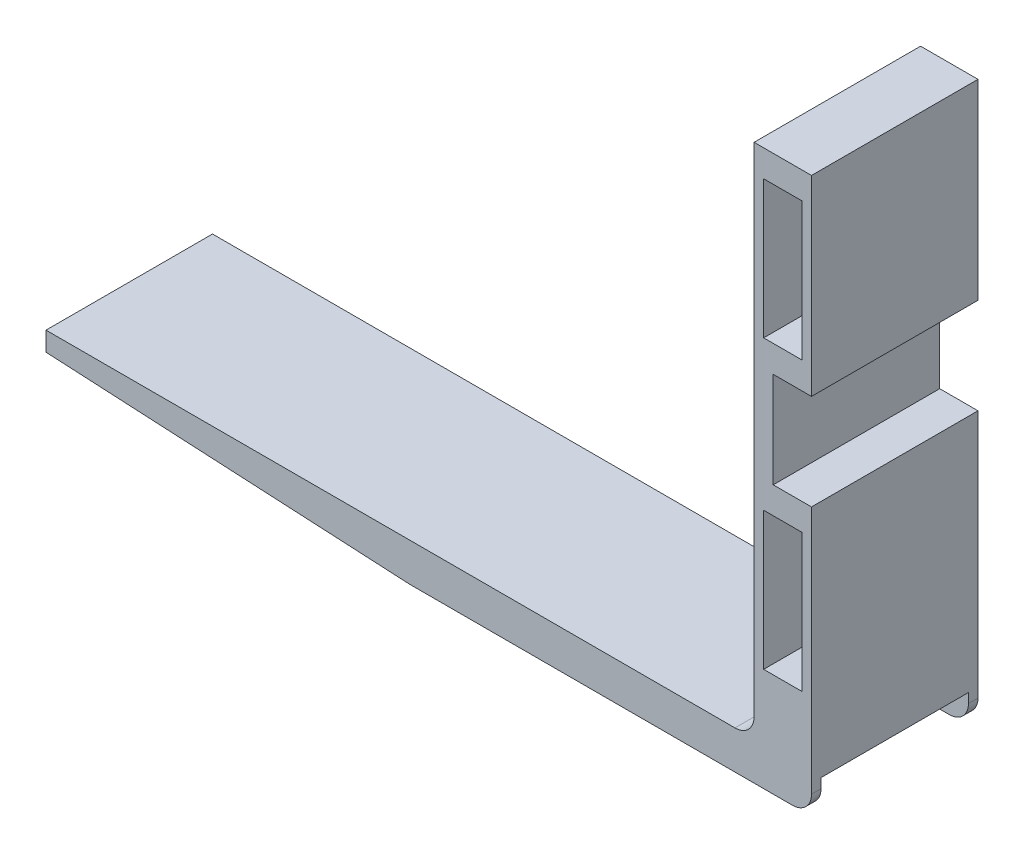
ISO-10303-21;
HEADER;
FILE_DESCRIPTION(('STEP AP214'),'2;1');
FILE_NAME('part.step','',(''),(''),'','','');
FILE_SCHEMA(('AUTOMOTIVE_DESIGN { 1 0 10303 214 1 1 1 1 }'));
ENDSEC;
DATA;
#1=APPLICATION_CONTEXT('core data for automotive mechanical design processes');
#2=APPLICATION_PROTOCOL_DEFINITION('international standard','automotive_design',2000,#1);
#3=PRODUCT_CONTEXT('',#1,'mechanical');
#4=PRODUCT('Part','Part','',(#3));
#5=PRODUCT_RELATED_PRODUCT_CATEGORY('part','',(#4));
#6=PRODUCT_DEFINITION_FORMATION('','',#4);
#7=PRODUCT_DEFINITION_CONTEXT('part definition',#1,'design');
#8=PRODUCT_DEFINITION('design','',#6,#7);
#9=PRODUCT_DEFINITION_SHAPE('','',#8);
#10=(LENGTH_UNIT() NAMED_UNIT(*) SI_UNIT(.MILLI.,.METRE.));
#11=(NAMED_UNIT(*) PLANE_ANGLE_UNIT() SI_UNIT($,.RADIAN.));
#12=(NAMED_UNIT(*) SI_UNIT($,.STERADIAN.) SOLID_ANGLE_UNIT());
#13=UNCERTAINTY_MEASURE_WITH_UNIT(LENGTH_MEASURE(1.E-05),#10,'distance_accuracy_value','');
#14=(GEOMETRIC_REPRESENTATION_CONTEXT(3) GLOBAL_UNCERTAINTY_ASSIGNED_CONTEXT((#13)) GLOBAL_UNIT_ASSIGNED_CONTEXT((#10,
#11,#12)) REPRESENTATION_CONTEXT('',''));
#15=CARTESIAN_POINT('',(0.,0.,0.));
#16=DIRECTION('',(0.,0.,1.));
#17=DIRECTION('',(1.,0.,0.));
#18=AXIS2_PLACEMENT_3D('',#15,#16,#17);
#19=CARTESIAN_POINT('',(-11.9999999999998,-160.294090378542,87.));
#20=DIRECTION('',(0.0525588331227632,0.99861782933251,0.));
#21=DIRECTION('',(-0.99861782933251,0.0525588331227632,0.));
#22=AXIS2_PLACEMENT_3D('',#19,#20,#21);
#23=PLANE('',#22);
#24=DIRECTION('',(0.,0.,-1.));
#25=VECTOR('',#24,1.);
#26=CARTESIAN_POINT('',(-202.,-150.294090378542,87.));
#27=LINE('',#26,#25);
#28=CARTESIAN_POINT('',(-202.,-150.294090378542,87.));
#29=VERTEX_POINT('',#28);
#30=CARTESIAN_POINT('',(-202.,-150.294090378542,82.0379413430987));
#31=VERTEX_POINT('',#30);
#32=EDGE_CURVE('E407',#29,#31,#27,.T.);
#33=ORIENTED_EDGE('',*,*,#32,.T.);
#34=DIRECTION('',(0.99861782933251,-0.0525588331227632,0.));
#35=VECTOR('',#34,1.);
#36=CARTESIAN_POINT('',(-11.9999999999998,-160.294090378542,82.0379413430987));
#37=LINE('',#36,#35);
#38=CARTESIAN_POINT('',(-11.9999999999998,-160.294090378542,82.0379413430987));
#39=VERTEX_POINT('',#38);
#40=EDGE_CURVE('E256',#31,#39,#37,.T.);
#41=ORIENTED_EDGE('',*,*,#40,.T.);
#42=DIRECTION('',(0.,0.,-1.));
#43=VECTOR('',#42,1.);
#44=CARTESIAN_POINT('',(-11.9999999999998,-160.294090378542,87.));
#45=LINE('',#44,#43);
#46=CARTESIAN_POINT('',(-11.9999999999998,-160.294090378542,87.));
#47=VERTEX_POINT('',#46);
#48=EDGE_CURVE('E404',#47,#39,#45,.T.);
#49=ORIENTED_EDGE('',*,*,#48,.F.);
#50=DIRECTION('',(0.99861782933251,-0.0525588331227632,0.));
#51=VECTOR('',#50,1.);
#52=CARTESIAN_POINT('',(-11.9999999999998,-160.294090378542,87.));
#53=LINE('',#52,#51);
#54=EDGE_CURVE('E330',#29,#47,#53,.T.);
#55=ORIENTED_EDGE('',*,*,#54,.F.);
#56=EDGE_LOOP('',(#33,#41,#49,#55));
#57=FACE_BOUND('',#56,.T.);
#58=ADVANCED_FACE('F39',(#57),#23,.F.);
#59=CARTESIAN_POINT('',(188.,-160.294090378542,87.));
#60=DIRECTION('',(0.,1.,0.));
#61=DIRECTION('',(-1.,0.,0.));
#62=AXIS2_PLACEMENT_3D('',#59,#60,#61);
#63=PLANE('',#62);
#64=ORIENTED_EDGE('',*,*,#48,.T.);
#65=DIRECTION('',(1.,0.,0.));
#66=VECTOR('',#65,1.);
#67=CARTESIAN_POINT('',(188.,-160.294090378542,82.0379413430987));
#68=LINE('',#67,#66);
#69=CARTESIAN_POINT('',(188.,-160.294090378542,82.0379413430987));
#70=VERTEX_POINT('',#69);
#71=EDGE_CURVE('E253',#39,#70,#68,.T.);
#72=ORIENTED_EDGE('',*,*,#71,.T.);
#73=DIRECTION('',(0.,0.,-1.));
#74=VECTOR('',#73,1.);
#75=CARTESIAN_POINT('',(188.,-160.294090378542,87.));
#76=LINE('',#75,#74);
#77=CARTESIAN_POINT('',(188.,-160.294090378542,87.));
#78=VERTEX_POINT('',#77);
#79=EDGE_CURVE('E400',#78,#70,#76,.T.);
#80=ORIENTED_EDGE('',*,*,#79,.F.);
#81=DIRECTION('',(1.,0.,0.));
#82=VECTOR('',#81,1.);
#83=CARTESIAN_POINT('',(188.,-160.294090378542,87.));
#84=LINE('',#83,#82);
#85=EDGE_CURVE('E332',#47,#78,#84,.T.);
#86=ORIENTED_EDGE('',*,*,#85,.F.);
#87=EDGE_LOOP('',(#64,#72,#80,#86));
#88=FACE_BOUND('',#87,.T.);
#89=ADVANCED_FACE('F479',(#88),#63,.F.);
#90=CARTESIAN_POINT('',(188.,-150.294090378542,87.));
#91=DIRECTION('',(0.,0.,-1.));
#92=DIRECTION('',(-1.,0.,0.));
#93=AXIS2_PLACEMENT_3D('',#90,#91,#92);
#94=CYLINDRICAL_SURFACE('',#93,9.99999999999998);
#95=ORIENTED_EDGE('',*,*,#79,.T.);
#96=CARTESIAN_POINT('',(188.,-150.294090378542,82.0379413430987));
#97=DIRECTION('',(0.,0.,1.));
#98=DIRECTION('',(1.,0.,0.));
#99=AXIS2_PLACEMENT_3D('',#96,#97,#98);
#100=CIRCLE('',#99,9.99999999999998);
#101=CARTESIAN_POINT('',(198.,-150.294090378542,82.0379413430987));
#102=VERTEX_POINT('',#101);
#103=EDGE_CURVE('E250',#70,#102,#100,.T.);
#104=ORIENTED_EDGE('',*,*,#103,.T.);
#105=DIRECTION('',(0.,0.,-1.));
#106=VECTOR('',#105,1.);
#107=CARTESIAN_POINT('',(198.,-150.294090378542,87.));
#108=LINE('',#107,#106);
#109=CARTESIAN_POINT('',(198.,-150.294090378542,87.));
#110=VERTEX_POINT('',#109);
#111=EDGE_CURVE('E396',#110,#102,#108,.T.);
#112=ORIENTED_EDGE('',*,*,#111,.F.);
#113=CARTESIAN_POINT('',(188.,-150.294090378542,87.));
#114=DIRECTION('',(0.,0.,1.));
#115=DIRECTION('',(1.,0.,0.));
#116=AXIS2_PLACEMENT_3D('',#113,#114,#115);
#117=CIRCLE('',#116,9.99999999999998);
#118=EDGE_CURVE('E334',#78,#110,#117,.T.);
#119=ORIENTED_EDGE('',*,*,#118,.F.);
#120=EDGE_LOOP('',(#95,#104,#112,#119));
#121=FACE_BOUND('',#120,.T.);
#122=ADVANCED_FACE('F477',(#121),#94,.T.);
#123=CARTESIAN_POINT('',(158.,-130.294090378542,87.));
#124=DIRECTION('',(0.,0.,-1.));
#125=DIRECTION('',(-1.,0.,0.));
#126=AXIS2_PLACEMENT_3D('',#123,#124,#125);
#127=PLANE('',#126);
#128=DIRECTION('',(0.,1.,0.));
#129=VECTOR('',#128,1.);
#130=CARTESIAN_POINT('',(193.,-34.2940903785418,87.));
#131=LINE('',#130,#129);
#132=CARTESIAN_POINT('',(193.,-106.294090378542,87.));
#133=VERTEX_POINT('',#132);
#134=CARTESIAN_POINT('',(193.,-34.2940903785418,87.));
#135=VERTEX_POINT('',#134);
#136=EDGE_CURVE('E289',#133,#135,#131,.T.);
#137=ORIENTED_EDGE('',*,*,#136,.F.);
#138=DIRECTION('',(1.,0.,0.));
#139=VECTOR('',#138,1.);
#140=CARTESIAN_POINT('',(173.,-106.294090378542,87.));
#141=LINE('',#140,#139);
#142=CARTESIAN_POINT('',(173.,-106.294090378542,87.));
#143=VERTEX_POINT('',#142);
#144=EDGE_CURVE('E297',#143,#133,#141,.T.);
#145=ORIENTED_EDGE('',*,*,#144,.F.);
#146=DIRECTION('',(0.,-1.,0.));
#147=VECTOR('',#146,1.);
#148=CARTESIAN_POINT('',(173.,-34.2940903785418,87.));
#149=LINE('',#148,#147);
#150=CARTESIAN_POINT('',(173.,-34.2940903785418,87.));
#151=VERTEX_POINT('',#150);
#152=EDGE_CURVE('E294',#151,#143,#149,.T.);
#153=ORIENTED_EDGE('',*,*,#152,.F.);
#154=DIRECTION('',(-1.,0.,0.));
#155=VECTOR('',#154,1.);
#156=CARTESIAN_POINT('',(173.,-34.2940903785418,87.));
#157=LINE('',#156,#155);
#158=EDGE_CURVE('E291',#135,#151,#157,.T.);
#159=ORIENTED_EDGE('',*,*,#158,.F.);
#160=EDGE_LOOP('',(#137,#145,#153,#159));
#161=FACE_BOUND('',#160,.T.);
#162=DIRECTION('',(0.,-1.,0.));
#163=VECTOR('',#162,1.);
#164=CARTESIAN_POINT('',(168.,129.705909621458,87.));
#165=LINE('',#164,#163);
#166=CARTESIAN_POINT('',(168.,129.705909621458,87.));
#167=VERTEX_POINT('',#166);
#168=CARTESIAN_POINT('',(168.,-130.294090378542,87.));
#169=VERTEX_POINT('',#168);
#170=EDGE_CURVE('E320',#167,#169,#165,.T.);
#171=ORIENTED_EDGE('',*,*,#170,.T.);
#172=CARTESIAN_POINT('',(158.,-130.294090378542,87.));
#173=DIRECTION('',(0.,0.,-1.));
#174=DIRECTION('',(-1.,0.,0.));
#175=AXIS2_PLACEMENT_3D('',#172,#173,#174);
#176=CIRCLE('',#175,10.);
#177=CARTESIAN_POINT('',(158.,-140.294090378542,87.));
#178=VERTEX_POINT('',#177);
#179=EDGE_CURVE('E323',#169,#178,#176,.T.);
#180=ORIENTED_EDGE('',*,*,#179,.T.);
#181=DIRECTION('',(-1.,0.,0.));
#182=VECTOR('',#181,1.);
#183=CARTESIAN_POINT('',(158.,-140.294090378542,87.));
#184=LINE('',#183,#182);
#185=CARTESIAN_POINT('',(-202.,-140.294090378542,87.));
#186=VERTEX_POINT('',#185);
#187=EDGE_CURVE('E326',#178,#186,#184,.T.);
#188=ORIENTED_EDGE('',*,*,#187,.T.);
#189=DIRECTION('',(0.,-1.,0.));
#190=VECTOR('',#189,1.);
#191=CARTESIAN_POINT('',(-202.,-150.294090378542,87.));
#192=LINE('',#191,#190);
#193=EDGE_CURVE('E328',#186,#29,#192,.T.);
#194=ORIENTED_EDGE('',*,*,#193,.T.);
#195=ORIENTED_EDGE('',*,*,#54,.T.);
#196=ORIENTED_EDGE('',*,*,#85,.T.);
#197=ORIENTED_EDGE('',*,*,#118,.T.);
#198=DIRECTION('',(0.,1.,0.));
#199=VECTOR('',#198,1.);
#200=CARTESIAN_POINT('',(198.,-150.294090378542,87.));
#201=LINE('',#200,#199);
#202=CARTESIAN_POINT('',(198.,-20.2940903785418,87.));
#203=VERTEX_POINT('',#202);
#204=EDGE_CURVE('E336',#110,#203,#201,.T.);
#205=ORIENTED_EDGE('',*,*,#204,.T.);
#206=DIRECTION('',(-1.,0.,0.));
#207=VECTOR('',#206,1.);
#208=CARTESIAN_POINT('',(178.,-20.2940903785418,87.));
#209=LINE('',#208,#207);
#210=CARTESIAN_POINT('',(178.,-20.2940903785418,87.));
#211=VERTEX_POINT('',#210);
#212=EDGE_CURVE('E338',#203,#211,#209,.T.);
#213=ORIENTED_EDGE('',*,*,#212,.T.);
#214=DIRECTION('',(0.,1.,0.));
#215=VECTOR('',#214,1.);
#216=CARTESIAN_POINT('',(178.,29.7059096214582,87.));
#217=LINE('',#216,#215);
#218=CARTESIAN_POINT('',(178.,29.7059096214582,87.));
#219=VERTEX_POINT('',#218);
#220=EDGE_CURVE('E340',#211,#219,#217,.T.);
#221=ORIENTED_EDGE('',*,*,#220,.T.);
#222=DIRECTION('',(1.,0.,0.));
#223=VECTOR('',#222,1.);
#224=CARTESIAN_POINT('',(198.,29.7059096214582,87.));
#225=LINE('',#224,#223);
#226=CARTESIAN_POINT('',(198.,29.7059096214582,87.));
#227=VERTEX_POINT('',#226);
#228=EDGE_CURVE('E342',#219,#227,#225,.T.);
#229=ORIENTED_EDGE('',*,*,#228,.T.);
#230=DIRECTION('',(0.,1.,0.));
#231=VECTOR('',#230,1.);
#232=CARTESIAN_POINT('',(198.,29.7059096214582,87.));
#233=LINE('',#232,#231);
#234=CARTESIAN_POINT('',(198.,129.705909621458,87.));
#235=VERTEX_POINT('',#234);
#236=EDGE_CURVE('E344',#227,#235,#233,.T.);
#237=ORIENTED_EDGE('',*,*,#236,.T.);
#238=DIRECTION('',(-1.,0.,0.));
#239=VECTOR('',#238,1.);
#240=CARTESIAN_POINT('',(198.,129.705909621458,87.));
#241=LINE('',#240,#239);
#242=EDGE_CURVE('E346',#235,#167,#241,.T.);
#243=ORIENTED_EDGE('',*,*,#242,.T.);
#244=EDGE_LOOP('',(#171,#180,#188,#194,#195,#196,#197,#205,#213,#221,#229,#237,#243));
#245=FACE_BOUND('',#244,.T.);
#246=DIRECTION('',(1.,0.,0.));
#247=VECTOR('',#246,1.);
#248=CARTESIAN_POINT('',(173.,43.7059096214582,87.));
#249=LINE('',#248,#247);
#250=CARTESIAN_POINT('',(173.,43.7059096214582,87.));
#251=VERTEX_POINT('',#250);
#252=CARTESIAN_POINT('',(193.,43.7059096214582,87.));
#253=VERTEX_POINT('',#252);
#254=EDGE_CURVE('E260',#251,#253,#249,.T.);
#255=ORIENTED_EDGE('',*,*,#254,.F.);
#256=DIRECTION('',(0.,-1.,0.));
#257=VECTOR('',#256,1.);
#258=CARTESIAN_POINT('',(173.,115.705909621458,87.));
#259=LINE('',#258,#257);
#260=CARTESIAN_POINT('',(173.,115.705909621458,87.));
#261=VERTEX_POINT('',#260);
#262=EDGE_CURVE('E267',#261,#251,#259,.T.);
#263=ORIENTED_EDGE('',*,*,#262,.F.);
#264=DIRECTION('',(-1.,0.,0.));
#265=VECTOR('',#264,1.);
#266=CARTESIAN_POINT('',(173.,115.705909621458,87.));
#267=LINE('',#266,#265);
#268=CARTESIAN_POINT('',(193.,115.705909621458,87.));
#269=VERTEX_POINT('',#268);
#270=EDGE_CURVE('E265',#269,#261,#267,.T.);
#271=ORIENTED_EDGE('',*,*,#270,.F.);
#272=DIRECTION('',(0.,1.,0.));
#273=VECTOR('',#272,1.);
#274=CARTESIAN_POINT('',(193.,115.705909621458,87.));
#275=LINE('',#274,#273);
#276=EDGE_CURVE('E262',#253,#269,#275,.T.);
#277=ORIENTED_EDGE('',*,*,#276,.F.);
#278=EDGE_LOOP('',(#255,#263,#271,#277));
#279=FACE_BOUND('',#278,.T.);
#280=ADVANCED_FACE('F431',(#161,#245,#279),#127,.F.);
#281=CARTESIAN_POINT('',(158.,-130.294090378542,0.));
#282=DIRECTION('',(0.,0.,-1.));
#283=DIRECTION('',(-1.,0.,0.));
#284=AXIS2_PLACEMENT_3D('',#281,#282,#283);
#285=PLANE('',#284);
#286=DIRECTION('',(0.,-1.,0.));
#287=VECTOR('',#286,1.);
#288=CARTESIAN_POINT('',(168.,129.705909621458,0.));
#289=LINE('',#288,#287);
#290=CARTESIAN_POINT('',(168.,129.705909621458,0.));
#291=VERTEX_POINT('',#290);
#292=CARTESIAN_POINT('',(168.,-130.294090378542,0.));
#293=VERTEX_POINT('',#292);
#294=EDGE_CURVE('E319',#291,#293,#289,.T.);
#295=ORIENTED_EDGE('',*,*,#294,.F.);
#296=DIRECTION('',(-1.,0.,0.));
#297=VECTOR('',#296,1.);
#298=CARTESIAN_POINT('',(198.,129.705909621458,0.));
#299=LINE('',#298,#297);
#300=CARTESIAN_POINT('',(198.,129.705909621458,0.));
#301=VERTEX_POINT('',#300);
#302=EDGE_CURVE('E324',#301,#291,#299,.T.);
#303=ORIENTED_EDGE('',*,*,#302,.F.);
#304=DIRECTION('',(0.,1.,0.));
#305=VECTOR('',#304,1.);
#306=CARTESIAN_POINT('',(198.,29.7059096214582,0.));
#307=LINE('',#306,#305);
#308=CARTESIAN_POINT('',(198.,29.7059096214582,0.));
#309=VERTEX_POINT('',#308);
#310=EDGE_CURVE('E375',#309,#301,#307,.T.);
#311=ORIENTED_EDGE('',*,*,#310,.F.);
#312=DIRECTION('',(1.,0.,0.));
#313=VECTOR('',#312,1.);
#314=CARTESIAN_POINT('',(198.,29.7059096214582,0.));
#315=LINE('',#314,#313);
#316=CARTESIAN_POINT('',(178.,29.7059096214582,0.));
#317=VERTEX_POINT('',#316);
#318=EDGE_CURVE('E373',#317,#309,#315,.T.);
#319=ORIENTED_EDGE('',*,*,#318,.F.);
#320=DIRECTION('',(0.,1.,0.));
#321=VECTOR('',#320,1.);
#322=CARTESIAN_POINT('',(178.,29.7059096214582,0.));
#323=LINE('',#322,#321);
#324=CARTESIAN_POINT('',(178.,-20.2940903785418,0.));
#325=VERTEX_POINT('',#324);
#326=EDGE_CURVE('E371',#325,#317,#323,.T.);
#327=ORIENTED_EDGE('',*,*,#326,.F.);
#328=DIRECTION('',(-1.,0.,0.));
#329=VECTOR('',#328,1.);
#330=CARTESIAN_POINT('',(178.,-20.2940903785418,0.));
#331=LINE('',#330,#329);
#332=CARTESIAN_POINT('',(198.,-20.2940903785418,0.));
#333=VERTEX_POINT('',#332);
#334=EDGE_CURVE('E369',#333,#325,#331,.T.);
#335=ORIENTED_EDGE('',*,*,#334,.F.);
#336=DIRECTION('',(0.,1.,0.));
#337=VECTOR('',#336,1.);
#338=CARTESIAN_POINT('',(198.,-150.294090378542,0.));
#339=LINE('',#338,#337);
#340=CARTESIAN_POINT('',(198.,-150.294090378542,0.));
#341=VERTEX_POINT('',#340);
#342=EDGE_CURVE('E367',#341,#333,#339,.T.);
#343=ORIENTED_EDGE('',*,*,#342,.F.);
#344=CARTESIAN_POINT('',(188.,-150.294090378542,0.));
#345=DIRECTION('',(0.,0.,1.));
#346=DIRECTION('',(1.,0.,0.));
#347=AXIS2_PLACEMENT_3D('',#344,#345,#346);
#348=CIRCLE('',#347,9.99999999999998);
#349=CARTESIAN_POINT('',(188.,-160.294090378542,0.));
#350=VERTEX_POINT('',#349);
#351=EDGE_CURVE('E364',#350,#341,#348,.T.);
#352=ORIENTED_EDGE('',*,*,#351,.F.);
#353=DIRECTION('',(1.,0.,0.));
#354=VECTOR('',#353,1.);
#355=CARTESIAN_POINT('',(188.,-160.294090378542,0.));
#356=LINE('',#355,#354);
#357=CARTESIAN_POINT('',(-11.9999999999998,-160.294090378542,0.));
#358=VERTEX_POINT('',#357);
#359=EDGE_CURVE('E361',#358,#350,#356,.T.);
#360=ORIENTED_EDGE('',*,*,#359,.F.);
#361=DIRECTION('',(0.99861782933251,-0.0525588331227632,0.));
#362=VECTOR('',#361,1.);
#363=CARTESIAN_POINT('',(-11.9999999999998,-160.294090378542,0.));
#364=LINE('',#363,#362);
#365=CARTESIAN_POINT('',(-202.,-150.294090378542,0.));
#366=VERTEX_POINT('',#365);
#367=EDGE_CURVE('E358',#366,#358,#364,.T.);
#368=ORIENTED_EDGE('',*,*,#367,.F.);
#369=DIRECTION('',(0.,-1.,0.));
#370=VECTOR('',#369,1.);
#371=CARTESIAN_POINT('',(-202.,-150.294090378542,0.));
#372=LINE('',#371,#370);
#373=CARTESIAN_POINT('',(-202.,-140.294090378542,0.));
#374=VERTEX_POINT('',#373);
#375=EDGE_CURVE('E356',#374,#366,#372,.T.);
#376=ORIENTED_EDGE('',*,*,#375,.F.);
#377=DIRECTION('',(-1.,0.,0.));
#378=VECTOR('',#377,1.);
#379=CARTESIAN_POINT('',(148.,-140.294090378542,0.));
#380=LINE('',#379,#378);
#381=CARTESIAN_POINT('',(158.,-140.294090378542,0.));
#382=VERTEX_POINT('',#381);
#383=EDGE_CURVE('E354',#382,#374,#380,.T.);
#384=ORIENTED_EDGE('',*,*,#383,.F.);
#385=CARTESIAN_POINT('',(158.,-130.294090378542,0.));
#386=DIRECTION('',(0.,0.,-1.));
#387=DIRECTION('',(-1.,0.,0.));
#388=AXIS2_PLACEMENT_3D('',#385,#386,#387);
#389=CIRCLE('',#388,10.);
#390=EDGE_CURVE('E351',#293,#382,#389,.T.);
#391=ORIENTED_EDGE('',*,*,#390,.F.);
#392=EDGE_LOOP('',(#295,#303,#311,#319,#327,#335,#343,#352,#360,#368,#376,#384,#391));
#393=FACE_BOUND('',#392,.T.);
#394=DIRECTION('',(1.,0.,0.));
#395=VECTOR('',#394,1.);
#396=CARTESIAN_POINT('',(173.,-106.294090378542,0.));
#397=LINE('',#396,#395);
#398=CARTESIAN_POINT('',(173.,-106.294090378542,0.));
#399=VERTEX_POINT('',#398);
#400=CARTESIAN_POINT('',(193.,-106.294090378542,0.));
#401=VERTEX_POINT('',#400);
#402=EDGE_CURVE('E292',#399,#401,#397,.T.);
#403=ORIENTED_EDGE('',*,*,#402,.T.);
#404=DIRECTION('',(0.,1.,0.));
#405=VECTOR('',#404,1.);
#406=CARTESIAN_POINT('',(193.,-34.2940903785418,0.));
#407=LINE('',#406,#405);
#408=CARTESIAN_POINT('',(193.,-34.2940903785418,0.));
#409=VERTEX_POINT('',#408);
#410=EDGE_CURVE('E288',#401,#409,#407,.T.);
#411=ORIENTED_EDGE('',*,*,#410,.T.);
#412=DIRECTION('',(-1.,0.,0.));
#413=VECTOR('',#412,1.);
#414=CARTESIAN_POINT('',(173.,-34.2940903785418,0.));
#415=LINE('',#414,#413);
#416=CARTESIAN_POINT('',(173.,-34.2940903785418,0.));
#417=VERTEX_POINT('',#416);
#418=EDGE_CURVE('E302',#409,#417,#415,.T.);
#419=ORIENTED_EDGE('',*,*,#418,.T.);
#420=DIRECTION('',(0.,-1.,0.));
#421=VECTOR('',#420,1.);
#422=CARTESIAN_POINT('',(173.,-34.2940903785418,0.));
#423=LINE('',#422,#421);
#424=EDGE_CURVE('E305',#417,#399,#423,.T.);
#425=ORIENTED_EDGE('',*,*,#424,.T.);
#426=EDGE_LOOP('',(#403,#411,#419,#425));
#427=FACE_BOUND('',#426,.T.);
#428=DIRECTION('',(0.,-1.,0.));
#429=VECTOR('',#428,1.);
#430=CARTESIAN_POINT('',(173.,115.705909621458,0.));
#431=LINE('',#430,#429);
#432=CARTESIAN_POINT('',(173.,115.705909621458,0.));
#433=VERTEX_POINT('',#432);
#434=CARTESIAN_POINT('',(173.,43.7059096214582,0.));
#435=VERTEX_POINT('',#434);
#436=EDGE_CURVE('E263',#433,#435,#431,.T.);
#437=ORIENTED_EDGE('',*,*,#436,.T.);
#438=DIRECTION('',(1.,0.,0.));
#439=VECTOR('',#438,1.);
#440=CARTESIAN_POINT('',(173.,43.7059096214582,0.));
#441=LINE('',#440,#439);
#442=CARTESIAN_POINT('',(193.,43.7059096214582,0.));
#443=VERTEX_POINT('',#442);
#444=EDGE_CURVE('E259',#435,#443,#441,.T.);
#445=ORIENTED_EDGE('',*,*,#444,.T.);
#446=DIRECTION('',(0.,1.,0.));
#447=VECTOR('',#446,1.);
#448=CARTESIAN_POINT('',(193.,115.705909621458,0.));
#449=LINE('',#448,#447);
#450=CARTESIAN_POINT('',(193.,115.705909621458,0.));
#451=VERTEX_POINT('',#450);
#452=EDGE_CURVE('E272',#443,#451,#449,.T.);
#453=ORIENTED_EDGE('',*,*,#452,.T.);
#454=DIRECTION('',(-1.,0.,0.));
#455=VECTOR('',#454,1.);
#456=CARTESIAN_POINT('',(173.,115.705909621458,0.));
#457=LINE('',#456,#455);
#458=EDGE_CURVE('E275',#451,#433,#457,.T.);
#459=ORIENTED_EDGE('',*,*,#458,.T.);
#460=EDGE_LOOP('',(#437,#445,#453,#459));
#461=FACE_BOUND('',#460,.T.);
#462=ADVANCED_FACE('F441',(#393,#427,#461),#285,.T.);
#463=CARTESIAN_POINT('',(168.,129.705909621458,87.));
#464=DIRECTION('',(1.,0.,0.));
#465=DIRECTION('',(0.,0.,-1.));
#466=AXIS2_PLACEMENT_3D('',#463,#464,#465);
#467=PLANE('',#466);
#468=ORIENTED_EDGE('',*,*,#294,.T.);
#469=DIRECTION('',(0.,0.,-1.));
#470=VECTOR('',#469,1.);
#471=CARTESIAN_POINT('',(168.,-130.294090378542,87.));
#472=LINE('',#471,#470);
#473=EDGE_CURVE('E416',#169,#293,#472,.T.);
#474=ORIENTED_EDGE('',*,*,#473,.F.);
#475=ORIENTED_EDGE('',*,*,#170,.F.);
#476=DIRECTION('',(0.,0.,-1.));
#477=VECTOR('',#476,1.);
#478=CARTESIAN_POINT('',(168.,129.705909621458,87.));
#479=LINE('',#478,#477);
#480=EDGE_CURVE('E348',#167,#291,#479,.T.);
#481=ORIENTED_EDGE('',*,*,#480,.T.);
#482=EDGE_LOOP('',(#468,#474,#475,#481));
#483=FACE_BOUND('',#482,.T.);
#484=ADVANCED_FACE('F41',(#483),#467,.F.);
#485=CARTESIAN_POINT('',(158.,-130.294090378542,87.));
#486=DIRECTION('',(0.,0.,-1.));
#487=DIRECTION('',(-1.,0.,0.));
#488=AXIS2_PLACEMENT_3D('',#485,#486,#487);
#489=CYLINDRICAL_SURFACE('',#488,10.);
#490=ORIENTED_EDGE('',*,*,#390,.T.);
#491=DIRECTION('',(0.,0.,-1.));
#492=VECTOR('',#491,1.);
#493=CARTESIAN_POINT('',(158.,-140.294090378542,87.));
#494=LINE('',#493,#492);
#495=EDGE_CURVE('E413',#178,#382,#494,.T.);
#496=ORIENTED_EDGE('',*,*,#495,.F.);
#497=ORIENTED_EDGE('',*,*,#179,.F.);
#498=ORIENTED_EDGE('',*,*,#473,.T.);
#499=EDGE_LOOP('',(#490,#496,#497,#498));
#500=FACE_BOUND('',#499,.T.);
#501=ADVANCED_FACE('F500',(#500),#489,.F.);
#502=CARTESIAN_POINT('',(148.,-140.294090378542,87.));
#503=DIRECTION('',(0.,-1.,0.));
#504=DIRECTION('',(1.,0.,0.));
#505=AXIS2_PLACEMENT_3D('',#502,#503,#504);
#506=PLANE('',#505);
#507=ORIENTED_EDGE('',*,*,#383,.T.);
#508=DIRECTION('',(0.,0.,-1.));
#509=VECTOR('',#508,1.);
#510=CARTESIAN_POINT('',(-202.,-140.294090378542,87.));
#511=LINE('',#510,#509);
#512=EDGE_CURVE('E410',#186,#374,#511,.T.);
#513=ORIENTED_EDGE('',*,*,#512,.F.);
#514=ORIENTED_EDGE('',*,*,#187,.F.);
#515=ORIENTED_EDGE('',*,*,#495,.T.);
#516=EDGE_LOOP('',(#507,#513,#514,#515));
#517=FACE_BOUND('',#516,.T.);
#518=ADVANCED_FACE('F496',(#517),#506,.F.);
#519=CARTESIAN_POINT('',(-202.,-150.294090378542,87.));
#520=DIRECTION('',(1.,0.,0.));
#521=DIRECTION('',(0.,0.,-1.));
#522=AXIS2_PLACEMENT_3D('',#519,#520,#521);
#523=PLANE('',#522);
#524=DIRECTION('',(0.,0.,-1.));
#525=VECTOR('',#524,1.);
#526=CARTESIAN_POINT('',(-202.,-145.294090378542,5.));
#527=LINE('',#526,#525);
#528=CARTESIAN_POINT('',(-202.,-145.294090378542,82.0379413430987));
#529=VERTEX_POINT('',#528);
#530=CARTESIAN_POINT('',(-202.,-145.294090378542,5.));
#531=VERTEX_POINT('',#530);
#532=EDGE_CURVE('E229',#529,#531,#527,.T.);
#533=ORIENTED_EDGE('',*,*,#532,.F.);
#534=DIRECTION('',(0.,1.,0.));
#535=VECTOR('',#534,1.);
#536=CARTESIAN_POINT('',(-202.,-145.294090378542,82.0379413430987));
#537=LINE('',#536,#535);
#538=EDGE_CURVE('E226',#31,#529,#537,.T.);
#539=ORIENTED_EDGE('',*,*,#538,.F.);
#540=ORIENTED_EDGE('',*,*,#32,.F.);
#541=ORIENTED_EDGE('',*,*,#193,.F.);
#542=ORIENTED_EDGE('',*,*,#512,.T.);
#543=ORIENTED_EDGE('',*,*,#375,.T.);
#544=CARTESIAN_POINT('',(-202.,-150.294090378542,5.));
#545=VERTEX_POINT('',#544);
#546=EDGE_CURVE('E239',#545,#366,#27,.T.);
#547=ORIENTED_EDGE('',*,*,#546,.F.);
#548=DIRECTION('',(0.,-1.,0.));
#549=VECTOR('',#548,1.);
#550=CARTESIAN_POINT('',(-202.,-145.294090378542,5.));
#551=LINE('',#550,#549);
#552=EDGE_CURVE('E220',#531,#545,#551,.T.);
#553=ORIENTED_EDGE('',*,*,#552,.F.);
#554=EDGE_LOOP('',(#533,#539,#540,#541,#542,#543,#547,#553));
#555=FACE_BOUND('',#554,.T.);
#556=ADVANCED_FACE('F237',(#555),#523,.F.);
#557=CARTESIAN_POINT('',(-11.9999999999998,-160.294090378542,5.));
#558=VERTEX_POINT('',#557);
#559=EDGE_CURVE('E403',#558,#358,#45,.T.);
#560=ORIENTED_EDGE('',*,*,#559,.F.);
#561=DIRECTION('',(-0.99861782933251,0.0525588331227632,0.));
#562=VECTOR('',#561,1.);
#563=CARTESIAN_POINT('',(-11.9999999999998,-160.294090378542,5.));
#564=LINE('',#563,#562);
#565=EDGE_CURVE('E248',#558,#545,#564,.T.);
#566=ORIENTED_EDGE('',*,*,#565,.T.);
#567=ORIENTED_EDGE('',*,*,#546,.T.);
#568=ORIENTED_EDGE('',*,*,#367,.T.);
#569=EDGE_LOOP('',(#560,#566,#567,#568));
#570=FACE_BOUND('',#569,.T.);
#571=ADVANCED_FACE('F447',(#570),#23,.F.);
#572=CARTESIAN_POINT('',(188.,-160.294090378542,5.));
#573=VERTEX_POINT('',#572);
#574=EDGE_CURVE('E399',#573,#350,#76,.T.);
#575=ORIENTED_EDGE('',*,*,#574,.F.);
#576=DIRECTION('',(-1.,0.,0.));
#577=VECTOR('',#576,1.);
#578=CARTESIAN_POINT('',(188.,-160.294090378542,5.));
#579=LINE('',#578,#577);
#580=EDGE_CURVE('E245',#573,#558,#579,.T.);
#581=ORIENTED_EDGE('',*,*,#580,.T.);
#582=ORIENTED_EDGE('',*,*,#559,.T.);
#583=ORIENTED_EDGE('',*,*,#359,.T.);
#584=EDGE_LOOP('',(#575,#581,#582,#583));
#585=FACE_BOUND('',#584,.T.);
#586=ADVANCED_FACE('F450',(#585),#63,.F.);
#587=CARTESIAN_POINT('',(198.,-150.294090378542,5.));
#588=VERTEX_POINT('',#587);
#589=EDGE_CURVE('E395',#588,#341,#108,.T.);
#590=ORIENTED_EDGE('',*,*,#589,.F.);
#591=CARTESIAN_POINT('',(188.,-150.294090378542,5.));
#592=DIRECTION('',(0.,0.,-1.));
#593=DIRECTION('',(-1.,0.,0.));
#594=AXIS2_PLACEMENT_3D('',#591,#592,#593);
#595=CIRCLE('',#594,9.99999999999998);
#596=EDGE_CURVE('E54',#588,#573,#595,.T.);
#597=ORIENTED_EDGE('',*,*,#596,.T.);
#598=ORIENTED_EDGE('',*,*,#574,.T.);
#599=ORIENTED_EDGE('',*,*,#351,.T.);
#600=EDGE_LOOP('',(#590,#597,#598,#599));
#601=FACE_BOUND('',#600,.T.);
#602=ADVANCED_FACE('F452',(#601),#94,.T.);
#603=CARTESIAN_POINT('',(198.,-150.294090378542,87.));
#604=DIRECTION('',(-1.,0.,0.));
#605=DIRECTION('',(0.,0.,1.));
#606=AXIS2_PLACEMENT_3D('',#603,#604,#605);
#607=PLANE('',#606);
#608=ORIENTED_EDGE('',*,*,#111,.T.);
#609=DIRECTION('',(0.,1.,0.));
#610=VECTOR('',#609,1.);
#611=CARTESIAN_POINT('',(198.,-150.294090378542,82.0379413430987));
#612=LINE('',#611,#610);
#613=CARTESIAN_POINT('',(198.,-145.294090378542,82.0379413430987));
#614=VERTEX_POINT('',#613);
#615=EDGE_CURVE('E11',#102,#614,#612,.T.);
#616=ORIENTED_EDGE('',*,*,#615,.T.);
#617=DIRECTION('',(0.,0.,-1.));
#618=VECTOR('',#617,1.);
#619=CARTESIAN_POINT('',(198.,-145.294090378542,87.));
#620=LINE('',#619,#618);
#621=CARTESIAN_POINT('',(198.,-145.294090378542,5.));
#622=VERTEX_POINT('',#621);
#623=EDGE_CURVE('E47',#614,#622,#620,.T.);
#624=ORIENTED_EDGE('',*,*,#623,.T.);
#625=DIRECTION('',(0.,-1.,0.));
#626=VECTOR('',#625,1.);
#627=CARTESIAN_POINT('',(198.,-150.294090378542,5.));
#628=LINE('',#627,#626);
#629=EDGE_CURVE('E222',#622,#588,#628,.T.);
#630=ORIENTED_EDGE('',*,*,#629,.T.);
#631=ORIENTED_EDGE('',*,*,#589,.T.);
#632=ORIENTED_EDGE('',*,*,#342,.T.);
#633=DIRECTION('',(0.,0.,-1.));
#634=VECTOR('',#633,1.);
#635=CARTESIAN_POINT('',(198.,-20.2940903785418,87.));
#636=LINE('',#635,#634);
#637=EDGE_CURVE('E392',#203,#333,#636,.T.);
#638=ORIENTED_EDGE('',*,*,#637,.F.);
#639=ORIENTED_EDGE('',*,*,#204,.F.);
#640=EDGE_LOOP('',(#608,#616,#624,#630,#631,#632,#638,#639));
#641=FACE_BOUND('',#640,.T.);
#642=ADVANCED_FACE('F420',(#641),#607,.F.);
#643=CARTESIAN_POINT('',(178.,-20.2940903785418,87.));
#644=DIRECTION('',(0.,-1.,0.));
#645=DIRECTION('',(0.,0.,-1.));
#646=AXIS2_PLACEMENT_3D('',#643,#644,#645);
#647=PLANE('',#646);
#648=ORIENTED_EDGE('',*,*,#334,.T.);
#649=DIRECTION('',(0.,0.,-1.));
#650=VECTOR('',#649,1.);
#651=CARTESIAN_POINT('',(178.,-20.2940903785418,87.));
#652=LINE('',#651,#650);
#653=EDGE_CURVE('E389',#211,#325,#652,.T.);
#654=ORIENTED_EDGE('',*,*,#653,.F.);
#655=ORIENTED_EDGE('',*,*,#212,.F.);
#656=ORIENTED_EDGE('',*,*,#637,.T.);
#657=EDGE_LOOP('',(#648,#654,#655,#656));
#658=FACE_BOUND('',#657,.T.);
#659=ADVANCED_FACE('F459',(#658),#647,.F.);
#660=CARTESIAN_POINT('',(178.,29.7059096214582,87.));
#661=DIRECTION('',(-1.,0.,0.));
#662=DIRECTION('',(0.,0.,1.));
#663=AXIS2_PLACEMENT_3D('',#660,#661,#662);
#664=PLANE('',#663);
#665=ORIENTED_EDGE('',*,*,#326,.T.);
#666=DIRECTION('',(0.,0.,-1.));
#667=VECTOR('',#666,1.);
#668=CARTESIAN_POINT('',(178.,29.7059096214582,87.));
#669=LINE('',#668,#667);
#670=EDGE_CURVE('E386',#219,#317,#669,.T.);
#671=ORIENTED_EDGE('',*,*,#670,.F.);
#672=ORIENTED_EDGE('',*,*,#220,.F.);
#673=ORIENTED_EDGE('',*,*,#653,.T.);
#674=EDGE_LOOP('',(#665,#671,#672,#673));
#675=FACE_BOUND('',#674,.T.);
#676=ADVANCED_FACE('F466',(#675),#664,.F.);
#677=CARTESIAN_POINT('',(198.,29.7059096214582,87.));
#678=DIRECTION('',(0.,1.,0.));
#679=DIRECTION('',(-1.,0.,0.));
#680=AXIS2_PLACEMENT_3D('',#677,#678,#679);
#681=PLANE('',#680);
#682=ORIENTED_EDGE('',*,*,#318,.T.);
#683=DIRECTION('',(0.,0.,-1.));
#684=VECTOR('',#683,1.);
#685=CARTESIAN_POINT('',(198.,29.7059096214582,87.));
#686=LINE('',#685,#684);
#687=EDGE_CURVE('E383',#227,#309,#686,.T.);
#688=ORIENTED_EDGE('',*,*,#687,.F.);
#689=ORIENTED_EDGE('',*,*,#228,.F.);
#690=ORIENTED_EDGE('',*,*,#670,.T.);
#691=EDGE_LOOP('',(#682,#688,#689,#690));
#692=FACE_BOUND('',#691,.T.);
#693=ADVANCED_FACE('F470',(#692),#681,.F.);
#694=CARTESIAN_POINT('',(198.,29.7059096214582,87.));
#695=DIRECTION('',(-1.,0.,0.));
#696=DIRECTION('',(0.,0.,1.));
#697=AXIS2_PLACEMENT_3D('',#694,#695,#696);
#698=PLANE('',#697);
#699=ORIENTED_EDGE('',*,*,#310,.T.);
#700=DIRECTION('',(0.,0.,-1.));
#701=VECTOR('',#700,1.);
#702=CARTESIAN_POINT('',(198.,129.705909621458,87.));
#703=LINE('',#702,#701);
#704=EDGE_CURVE('E380',#235,#301,#703,.T.);
#705=ORIENTED_EDGE('',*,*,#704,.F.);
#706=ORIENTED_EDGE('',*,*,#236,.F.);
#707=ORIENTED_EDGE('',*,*,#687,.T.);
#708=EDGE_LOOP('',(#699,#705,#706,#707));
#709=FACE_BOUND('',#708,.T.);
#710=ADVANCED_FACE('F516',(#709),#698,.F.);
#711=CARTESIAN_POINT('',(198.,129.705909621458,87.));
#712=DIRECTION('',(0.,-1.,0.));
#713=DIRECTION('',(1.,0.,0.));
#714=AXIS2_PLACEMENT_3D('',#711,#712,#713);
#715=PLANE('',#714);
#716=ORIENTED_EDGE('',*,*,#302,.T.);
#717=ORIENTED_EDGE('',*,*,#480,.F.);
#718=ORIENTED_EDGE('',*,*,#242,.F.);
#719=ORIENTED_EDGE('',*,*,#704,.T.);
#720=EDGE_LOOP('',(#716,#717,#718,#719));
#721=FACE_BOUND('',#720,.T.);
#722=ADVANCED_FACE('F514',(#721),#715,.F.);
#723=CARTESIAN_POINT('',(193.,-34.2940903785418,87.));
#724=DIRECTION('',(-1.,0.,0.));
#725=DIRECTION('',(0.,0.,1.));
#726=AXIS2_PLACEMENT_3D('',#723,#724,#725);
#727=PLANE('',#726);
#728=ORIENTED_EDGE('',*,*,#410,.F.);
#729=DIRECTION('',(0.,0.,-1.));
#730=VECTOR('',#729,1.);
#731=CARTESIAN_POINT('',(193.,-106.294090378542,87.));
#732=LINE('',#731,#730);
#733=EDGE_CURVE('E299',#133,#401,#732,.T.);
#734=ORIENTED_EDGE('',*,*,#733,.F.);
#735=ORIENTED_EDGE('',*,*,#136,.T.);
#736=DIRECTION('',(0.,0.,-1.));
#737=VECTOR('',#736,1.);
#738=CARTESIAN_POINT('',(193.,-34.2940903785418,87.));
#739=LINE('',#738,#737);
#740=EDGE_CURVE('E316',#135,#409,#739,.T.);
#741=ORIENTED_EDGE('',*,*,#740,.T.);
#742=EDGE_LOOP('',(#728,#734,#735,#741));
#743=FACE_BOUND('',#742,.T.);
#744=ADVANCED_FACE('F523',(#743),#727,.T.);
#745=CARTESIAN_POINT('',(173.,-34.2940903785418,87.));
#746=DIRECTION('',(0.,-1.,0.));
#747=DIRECTION('',(1.,0.,0.));
#748=AXIS2_PLACEMENT_3D('',#745,#746,#747);
#749=PLANE('',#748);
#750=ORIENTED_EDGE('',*,*,#418,.F.);
#751=ORIENTED_EDGE('',*,*,#740,.F.);
#752=ORIENTED_EDGE('',*,*,#158,.T.);
#753=DIRECTION('',(0.,0.,-1.));
#754=VECTOR('',#753,1.);
#755=CARTESIAN_POINT('',(173.,-34.2940903785418,87.));
#756=LINE('',#755,#754);
#757=EDGE_CURVE('E314',#151,#417,#756,.T.);
#758=ORIENTED_EDGE('',*,*,#757,.T.);
#759=EDGE_LOOP('',(#750,#751,#752,#758));
#760=FACE_BOUND('',#759,.T.);
#761=ADVANCED_FACE('F570',(#760),#749,.T.);
#762=CARTESIAN_POINT('',(173.,-34.2940903785418,87.));
#763=DIRECTION('',(1.,0.,0.));
#764=DIRECTION('',(0.,1.,0.));
#765=AXIS2_PLACEMENT_3D('',#762,#763,#764);
#766=PLANE('',#765);
#767=ORIENTED_EDGE('',*,*,#424,.F.);
#768=ORIENTED_EDGE('',*,*,#757,.F.);
#769=ORIENTED_EDGE('',*,*,#152,.T.);
#770=DIRECTION('',(0.,0.,-1.));
#771=VECTOR('',#770,1.);
#772=CARTESIAN_POINT('',(173.,-106.294090378542,87.));
#773=LINE('',#772,#771);
#774=EDGE_CURVE('E312',#143,#399,#773,.T.);
#775=ORIENTED_EDGE('',*,*,#774,.T.);
#776=EDGE_LOOP('',(#767,#768,#769,#775));
#777=FACE_BOUND('',#776,.T.);
#778=ADVANCED_FACE('F580',(#777),#766,.T.);
#779=CARTESIAN_POINT('',(173.,-106.294090378542,87.));
#780=DIRECTION('',(0.,1.,0.));
#781=DIRECTION('',(-1.,0.,0.));
#782=AXIS2_PLACEMENT_3D('',#779,#780,#781);
#783=PLANE('',#782);
#784=ORIENTED_EDGE('',*,*,#402,.F.);
#785=ORIENTED_EDGE('',*,*,#774,.F.);
#786=ORIENTED_EDGE('',*,*,#144,.T.);
#787=ORIENTED_EDGE('',*,*,#733,.T.);
#788=EDGE_LOOP('',(#784,#785,#786,#787));
#789=FACE_BOUND('',#788,.T.);
#790=ADVANCED_FACE('F590',(#789),#783,.T.);
#791=CARTESIAN_POINT('',(173.,43.7059096214582,87.));
#792=DIRECTION('',(0.,1.,0.));
#793=DIRECTION('',(0.,0.,1.));
#794=AXIS2_PLACEMENT_3D('',#791,#792,#793);
#795=PLANE('',#794);
#796=ORIENTED_EDGE('',*,*,#444,.F.);
#797=DIRECTION('',(0.,0.,-1.));
#798=VECTOR('',#797,1.);
#799=CARTESIAN_POINT('',(173.,43.7059096214582,87.));
#800=LINE('',#799,#798);
#801=EDGE_CURVE('E269',#251,#435,#800,.T.);
#802=ORIENTED_EDGE('',*,*,#801,.F.);
#803=ORIENTED_EDGE('',*,*,#254,.T.);
#804=DIRECTION('',(0.,0.,-1.));
#805=VECTOR('',#804,1.);
#806=CARTESIAN_POINT('',(193.,43.7059096214582,87.));
#807=LINE('',#806,#805);
#808=EDGE_CURVE('E285',#253,#443,#807,.T.);
#809=ORIENTED_EDGE('',*,*,#808,.T.);
#810=EDGE_LOOP('',(#796,#802,#803,#809));
#811=FACE_BOUND('',#810,.T.);
#812=ADVANCED_FACE('F600',(#811),#795,.T.);
#813=CARTESIAN_POINT('',(193.,115.705909621458,87.));
#814=DIRECTION('',(-1.,0.,0.));
#815=DIRECTION('',(0.,-1.,0.));
#816=AXIS2_PLACEMENT_3D('',#813,#814,#815);
#817=PLANE('',#816);
#818=ORIENTED_EDGE('',*,*,#452,.F.);
#819=ORIENTED_EDGE('',*,*,#808,.F.);
#820=ORIENTED_EDGE('',*,*,#276,.T.);
#821=DIRECTION('',(0.,0.,-1.));
#822=VECTOR('',#821,1.);
#823=CARTESIAN_POINT('',(193.,115.705909621458,87.));
#824=LINE('',#823,#822);
#825=EDGE_CURVE('E283',#269,#451,#824,.T.);
#826=ORIENTED_EDGE('',*,*,#825,.T.);
#827=EDGE_LOOP('',(#818,#819,#820,#826));
#828=FACE_BOUND('',#827,.T.);
#829=ADVANCED_FACE('F610',(#828),#817,.T.);
#830=CARTESIAN_POINT('',(173.,115.705909621458,87.));
#831=DIRECTION('',(0.,-1.,0.));
#832=DIRECTION('',(1.,0.,0.));
#833=AXIS2_PLACEMENT_3D('',#830,#831,#832);
#834=PLANE('',#833);
#835=ORIENTED_EDGE('',*,*,#458,.F.);
#836=ORIENTED_EDGE('',*,*,#825,.F.);
#837=ORIENTED_EDGE('',*,*,#270,.T.);
#838=DIRECTION('',(0.,0.,-1.));
#839=VECTOR('',#838,1.);
#840=CARTESIAN_POINT('',(173.,115.705909621458,87.));
#841=LINE('',#840,#839);
#842=EDGE_CURVE('E62',#261,#433,#841,.T.);
#843=ORIENTED_EDGE('',*,*,#842,.T.);
#844=EDGE_LOOP('',(#835,#836,#837,#843));
#845=FACE_BOUND('',#844,.T.);
#846=ADVANCED_FACE('F620',(#845),#834,.T.);
#847=CARTESIAN_POINT('',(173.,115.705909621458,87.));
#848=DIRECTION('',(1.,0.,0.));
#849=DIRECTION('',(0.,0.,-1.));
#850=AXIS2_PLACEMENT_3D('',#847,#848,#849);
#851=PLANE('',#850);
#852=ORIENTED_EDGE('',*,*,#436,.F.);
#853=ORIENTED_EDGE('',*,*,#842,.F.);
#854=ORIENTED_EDGE('',*,*,#262,.T.);
#855=ORIENTED_EDGE('',*,*,#801,.T.);
#856=EDGE_LOOP('',(#852,#853,#854,#855));
#857=FACE_BOUND('',#856,.T.);
#858=ADVANCED_FACE('F630',(#857),#851,.T.);
#859=CARTESIAN_POINT('',(218.,-145.294090378542,5.));
#860=DIRECTION('',(0.,1.,0.));
#861=DIRECTION('',(0.,0.,1.));
#862=AXIS2_PLACEMENT_3D('',#859,#860,#861);
#863=PLANE('',#862);
#864=DIRECTION('',(-1.,0.,0.));
#865=VECTOR('',#864,1.);
#866=CARTESIAN_POINT('',(218.,-145.294090378542,82.0379413430987));
#867=LINE('',#866,#865);
#868=EDGE_CURVE('E225',#614,#529,#867,.T.);
#869=ORIENTED_EDGE('',*,*,#868,.T.);
#870=ORIENTED_EDGE('',*,*,#532,.T.);
#871=DIRECTION('',(-1.,0.,0.));
#872=VECTOR('',#871,1.);
#873=CARTESIAN_POINT('',(218.,-145.294090378542,5.));
#874=LINE('',#873,#872);
#875=EDGE_CURVE('E216',#622,#531,#874,.T.);
#876=ORIENTED_EDGE('',*,*,#875,.F.);
#877=ORIENTED_EDGE('',*,*,#623,.F.);
#878=EDGE_LOOP('',(#869,#870,#876,#877));
#879=FACE_BOUND('',#878,.T.);
#880=ADVANCED_FACE('F230',(#879),#863,.F.);
#881=CARTESIAN_POINT('',(218.,-145.294090378542,82.0379413430987));
#882=DIRECTION('',(0.,0.,1.));
#883=DIRECTION('',(1.,0.,0.));
#884=AXIS2_PLACEMENT_3D('',#881,#882,#883);
#885=PLANE('',#884);
#886=ORIENTED_EDGE('',*,*,#538,.T.);
#887=ORIENTED_EDGE('',*,*,#868,.F.);
#888=ORIENTED_EDGE('',*,*,#615,.F.);
#889=ORIENTED_EDGE('',*,*,#103,.F.);
#890=ORIENTED_EDGE('',*,*,#71,.F.);
#891=ORIENTED_EDGE('',*,*,#40,.F.);
#892=EDGE_LOOP('',(#886,#887,#888,#889,#890,#891));
#893=FACE_BOUND('',#892,.T.);
#894=ADVANCED_FACE('F423',(#893),#885,.F.);
#895=CARTESIAN_POINT('',(218.,-145.294090378542,5.));
#896=DIRECTION('',(0.,0.,-1.));
#897=DIRECTION('',(-1.,0.,0.));
#898=AXIS2_PLACEMENT_3D('',#895,#896,#897);
#899=PLANE('',#898);
#900=ORIENTED_EDGE('',*,*,#580,.F.);
#901=ORIENTED_EDGE('',*,*,#596,.F.);
#902=ORIENTED_EDGE('',*,*,#629,.F.);
#903=ORIENTED_EDGE('',*,*,#875,.T.);
#904=ORIENTED_EDGE('',*,*,#552,.T.);
#905=ORIENTED_EDGE('',*,*,#565,.F.);
#906=EDGE_LOOP('',(#900,#901,#902,#903,#904,#905));
#907=FACE_BOUND('',#906,.T.);
#908=ADVANCED_FACE('F218',(#907),#899,.F.);
#909=CLOSED_SHELL('',(#58,#89,#122,#280,#462,#484,#501,#518,#556,#571,#586,#602,#642,#659,#676,
#693,#710,#722,#744,#761,#778,#790,#812,#829,#846,#858,#880,#894,#908));
#910=MANIFOLD_SOLID_BREP('B2',#909);
#911=ADVANCED_BREP_SHAPE_REPRESENTATION('',(#18,#910),#14);
#912=SHAPE_DEFINITION_REPRESENTATION(#9,#911);
ENDSEC;
END-ISO-10303-21;
